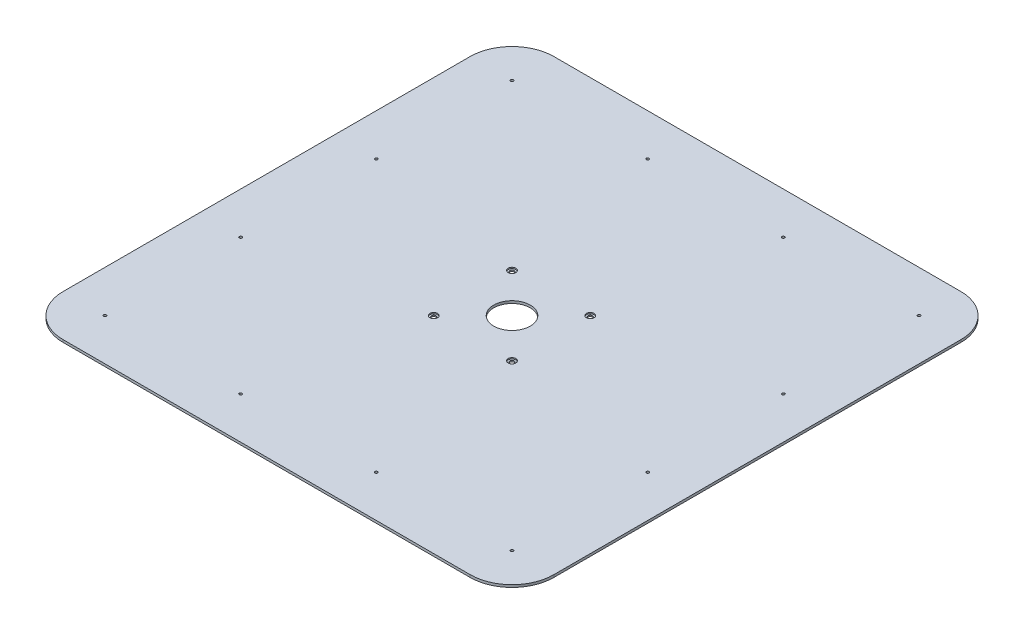
ISO-10303-21;
HEADER;
FILE_DESCRIPTION(('STEP AP214'),'2;1');
FILE_NAME('part.step','',(''),(''),'','','');
FILE_SCHEMA(('AUTOMOTIVE_DESIGN { 1 0 10303 214 1 1 1 1 }'));
ENDSEC;
DATA;
#1=APPLICATION_CONTEXT('core data for automotive mechanical design processes');
#2=APPLICATION_PROTOCOL_DEFINITION('international standard','automotive_design',2000,#1);
#3=PRODUCT_CONTEXT('',#1,'mechanical');
#4=PRODUCT('Part','Part','',(#3));
#5=PRODUCT_RELATED_PRODUCT_CATEGORY('part','',(#4));
#6=PRODUCT_DEFINITION_FORMATION('','',#4);
#7=PRODUCT_DEFINITION_CONTEXT('part definition',#1,'design');
#8=PRODUCT_DEFINITION('design','',#6,#7);
#9=PRODUCT_DEFINITION_SHAPE('','',#8);
#10=(LENGTH_UNIT() NAMED_UNIT(*) SI_UNIT(.MILLI.,.METRE.));
#11=(NAMED_UNIT(*) PLANE_ANGLE_UNIT() SI_UNIT($,.RADIAN.));
#12=(NAMED_UNIT(*) SI_UNIT($,.STERADIAN.) SOLID_ANGLE_UNIT());
#13=UNCERTAINTY_MEASURE_WITH_UNIT(LENGTH_MEASURE(1.E-05),#10,'distance_accuracy_value','');
#14=(GEOMETRIC_REPRESENTATION_CONTEXT(3) GLOBAL_UNCERTAINTY_ASSIGNED_CONTEXT((#13)) GLOBAL_UNIT_ASSIGNED_CONTEXT((#10,
#11,#12)) REPRESENTATION_CONTEXT('',''));
#15=CARTESIAN_POINT('',(0.,0.,0.));
#16=DIRECTION('',(0.,0.,1.));
#17=DIRECTION('',(1.,0.,0.));
#18=AXIS2_PLACEMENT_3D('',#15,#16,#17);
#19=CARTESIAN_POINT('',(-47.625,1.5,47.625));
#20=DIRECTION('',(0.,1.,0.));
#21=DIRECTION('',(0.,0.,1.));
#22=AXIS2_PLACEMENT_3D('',#19,#20,#21);
#23=CYLINDRICAL_SURFACE('',#22,4.699);
#24=CARTESIAN_POINT('',(-47.625,3.,47.625));
#25=DIRECTION('',(0.,1.,0.));
#26=DIRECTION('',(0.,0.,1.));
#27=AXIS2_PLACEMENT_3D('',#24,#25,#26);
#28=CIRCLE('',#27,4.699);
#29=CARTESIAN_POINT('',(-47.625,3.,52.324));
#30=VERTEX_POINT('',#29);
#31=EDGE_CURVE('E245',#30,#30,#28,.F.);
#32=ORIENTED_EDGE('',*,*,#31,.F.);
#33=EDGE_LOOP('',(#32));
#34=FACE_BOUND('',#33,.T.);
#35=CARTESIAN_POINT('',(-47.625,1.5,47.625));
#36=DIRECTION('',(0.,1.,0.));
#37=DIRECTION('',(0.,0.,1.));
#38=AXIS2_PLACEMENT_3D('',#35,#36,#37);
#39=CIRCLE('',#38,4.699);
#40=CARTESIAN_POINT('',(-47.625,1.5,52.324));
#41=VERTEX_POINT('',#40);
#42=EDGE_CURVE('E20',#41,#41,#39,.T.);
#43=ORIENTED_EDGE('',*,*,#42,.F.);
#44=EDGE_LOOP('',(#43));
#45=FACE_BOUND('',#44,.T.);
#46=ADVANCED_FACE('F17',(#34,#45),#23,.F.);
#47=CARTESIAN_POINT('',(47.625,1.5,47.625));
#48=DIRECTION('',(0.,1.,0.));
#49=DIRECTION('',(0.,0.,1.));
#50=AXIS2_PLACEMENT_3D('',#47,#48,#49);
#51=CYLINDRICAL_SURFACE('',#50,4.699);
#52=CARTESIAN_POINT('',(47.625,3.,47.625));
#53=DIRECTION('',(0.,1.,0.));
#54=DIRECTION('',(0.,0.,1.));
#55=AXIS2_PLACEMENT_3D('',#52,#53,#54);
#56=CIRCLE('',#55,4.699);
#57=CARTESIAN_POINT('',(47.625,3.,52.324));
#58=VERTEX_POINT('',#57);
#59=EDGE_CURVE('E242',#58,#58,#56,.F.);
#60=ORIENTED_EDGE('',*,*,#59,.F.);
#61=EDGE_LOOP('',(#60));
#62=FACE_BOUND('',#61,.T.);
#63=CARTESIAN_POINT('',(47.625,1.5,47.625));
#64=DIRECTION('',(0.,1.,0.));
#65=DIRECTION('',(0.,0.,1.));
#66=AXIS2_PLACEMENT_3D('',#63,#64,#65);
#67=CIRCLE('',#66,4.699);
#68=CARTESIAN_POINT('',(47.625,1.5,52.324));
#69=VERTEX_POINT('',#68);
#70=EDGE_CURVE('E253',#69,#69,#67,.T.);
#71=ORIENTED_EDGE('',*,*,#70,.F.);
#72=EDGE_LOOP('',(#71));
#73=FACE_BOUND('',#72,.T.);
#74=ADVANCED_FACE('F263',(#62,#73),#51,.F.);
#75=CARTESIAN_POINT('',(47.625,1.5,-47.625));
#76=DIRECTION('',(0.,1.,0.));
#77=DIRECTION('',(0.,0.,1.));
#78=AXIS2_PLACEMENT_3D('',#75,#76,#77);
#79=CYLINDRICAL_SURFACE('',#78,4.699);
#80=CARTESIAN_POINT('',(47.625,3.,-47.625));
#81=DIRECTION('',(0.,1.,0.));
#82=DIRECTION('',(0.,0.,1.));
#83=AXIS2_PLACEMENT_3D('',#80,#81,#82);
#84=CIRCLE('',#83,4.699);
#85=CARTESIAN_POINT('',(47.625,3.,-42.926));
#86=VERTEX_POINT('',#85);
#87=EDGE_CURVE('E239',#86,#86,#84,.F.);
#88=ORIENTED_EDGE('',*,*,#87,.F.);
#89=EDGE_LOOP('',(#88));
#90=FACE_BOUND('',#89,.T.);
#91=CARTESIAN_POINT('',(47.625,1.5,-47.625));
#92=DIRECTION('',(0.,1.,0.));
#93=DIRECTION('',(0.,0.,1.));
#94=AXIS2_PLACEMENT_3D('',#91,#92,#93);
#95=CIRCLE('',#94,4.699);
#96=CARTESIAN_POINT('',(47.625,1.5,-42.926));
#97=VERTEX_POINT('',#96);
#98=EDGE_CURVE('E251',#97,#97,#95,.T.);
#99=ORIENTED_EDGE('',*,*,#98,.F.);
#100=EDGE_LOOP('',(#99));
#101=FACE_BOUND('',#100,.T.);
#102=ADVANCED_FACE('F269',(#90,#101),#79,.F.);
#103=CARTESIAN_POINT('',(-47.625,1.5,-47.625));
#104=DIRECTION('',(0.,1.,0.));
#105=DIRECTION('',(0.,0.,1.));
#106=AXIS2_PLACEMENT_3D('',#103,#104,#105);
#107=CYLINDRICAL_SURFACE('',#106,4.699);
#108=CARTESIAN_POINT('',(-47.625,3.,-47.625));
#109=DIRECTION('',(0.,1.,0.));
#110=DIRECTION('',(0.,0.,1.));
#111=AXIS2_PLACEMENT_3D('',#108,#109,#110);
#112=CIRCLE('',#111,4.699);
#113=CARTESIAN_POINT('',(-47.625,3.,-42.926));
#114=VERTEX_POINT('',#113);
#115=EDGE_CURVE('E236',#114,#114,#112,.F.);
#116=ORIENTED_EDGE('',*,*,#115,.F.);
#117=EDGE_LOOP('',(#116));
#118=FACE_BOUND('',#117,.T.);
#119=CARTESIAN_POINT('',(-47.625,1.5,-47.625));
#120=DIRECTION('',(0.,1.,0.));
#121=DIRECTION('',(0.,0.,1.));
#122=AXIS2_PLACEMENT_3D('',#119,#120,#121);
#123=CIRCLE('',#122,4.699);
#124=CARTESIAN_POINT('',(-47.625,1.5,-42.926));
#125=VERTEX_POINT('',#124);
#126=EDGE_CURVE('E248',#125,#125,#123,.T.);
#127=ORIENTED_EDGE('',*,*,#126,.F.);
#128=EDGE_LOOP('',(#127));
#129=FACE_BOUND('',#128,.T.);
#130=ADVANCED_FACE('F393',(#118,#129),#107,.F.);
#131=CARTESIAN_POINT('',(-47.625,1.5,47.625));
#132=DIRECTION('',(0.,1.,0.));
#133=DIRECTION('',(0.,0.,1.));
#134=AXIS2_PLACEMENT_3D('',#131,#132,#133);
#135=PLANE('',#134);
#136=CARTESIAN_POINT('',(-47.625,1.5,47.625));
#137=DIRECTION('',(0.,1.,0.));
#138=DIRECTION('',(0.,0.,1.));
#139=AXIS2_PLACEMENT_3D('',#136,#137,#138);
#140=CIRCLE('',#139,2.667);
#141=CARTESIAN_POINT('',(-47.625,1.5,50.292));
#142=VERTEX_POINT('',#141);
#143=EDGE_CURVE('E233',#142,#142,#140,.F.);
#144=ORIENTED_EDGE('',*,*,#143,.T.);
#145=EDGE_LOOP('',(#144));
#146=FACE_BOUND('',#145,.T.);
#147=ORIENTED_EDGE('',*,*,#42,.T.);
#148=EDGE_LOOP('',(#147));
#149=FACE_BOUND('',#148,.T.);
#150=ADVANCED_FACE('F260',(#146,#149),#135,.T.);
#151=CARTESIAN_POINT('',(47.625,1.5,47.625));
#152=DIRECTION('',(0.,1.,0.));
#153=DIRECTION('',(0.,0.,1.));
#154=AXIS2_PLACEMENT_3D('',#151,#152,#153);
#155=PLANE('',#154);
#156=CARTESIAN_POINT('',(47.625,1.5,47.625));
#157=DIRECTION('',(0.,1.,0.));
#158=DIRECTION('',(0.,0.,1.));
#159=AXIS2_PLACEMENT_3D('',#156,#157,#158);
#160=CIRCLE('',#159,2.667);
#161=CARTESIAN_POINT('',(47.625,1.5,50.292));
#162=VERTEX_POINT('',#161);
#163=EDGE_CURVE('E230',#162,#162,#160,.F.);
#164=ORIENTED_EDGE('',*,*,#163,.T.);
#165=EDGE_LOOP('',(#164));
#166=FACE_BOUND('',#165,.T.);
#167=ORIENTED_EDGE('',*,*,#70,.T.);
#168=EDGE_LOOP('',(#167));
#169=FACE_BOUND('',#168,.T.);
#170=ADVANCED_FACE('F386',(#166,#169),#155,.T.);
#171=CARTESIAN_POINT('',(47.625,1.5,-47.625));
#172=DIRECTION('',(0.,1.,0.));
#173=DIRECTION('',(0.,0.,1.));
#174=AXIS2_PLACEMENT_3D('',#171,#172,#173);
#175=PLANE('',#174);
#176=CARTESIAN_POINT('',(47.625,1.5,-47.625));
#177=DIRECTION('',(0.,1.,0.));
#178=DIRECTION('',(0.,0.,1.));
#179=AXIS2_PLACEMENT_3D('',#176,#177,#178);
#180=CIRCLE('',#179,2.667);
#181=CARTESIAN_POINT('',(47.625,1.5,-44.958));
#182=VERTEX_POINT('',#181);
#183=EDGE_CURVE('E227',#182,#182,#180,.F.);
#184=ORIENTED_EDGE('',*,*,#183,.T.);
#185=EDGE_LOOP('',(#184));
#186=FACE_BOUND('',#185,.T.);
#187=ORIENTED_EDGE('',*,*,#98,.T.);
#188=EDGE_LOOP('',(#187));
#189=FACE_BOUND('',#188,.T.);
#190=ADVANCED_FACE('F382',(#186,#189),#175,.T.);
#191=CARTESIAN_POINT('',(-47.625,1.5,-47.625));
#192=DIRECTION('',(0.,1.,0.));
#193=DIRECTION('',(0.,0.,1.));
#194=AXIS2_PLACEMENT_3D('',#191,#192,#193);
#195=PLANE('',#194);
#196=CARTESIAN_POINT('',(-47.625,1.5,-47.625));
#197=DIRECTION('',(0.,1.,0.));
#198=DIRECTION('',(0.,0.,1.));
#199=AXIS2_PLACEMENT_3D('',#196,#197,#198);
#200=CIRCLE('',#199,2.667);
#201=CARTESIAN_POINT('',(-47.625,1.5,-44.958));
#202=VERTEX_POINT('',#201);
#203=EDGE_CURVE('E224',#202,#202,#200,.F.);
#204=ORIENTED_EDGE('',*,*,#203,.T.);
#205=EDGE_LOOP('',(#204));
#206=FACE_BOUND('',#205,.T.);
#207=ORIENTED_EDGE('',*,*,#126,.T.);
#208=EDGE_LOOP('',(#207));
#209=FACE_BOUND('',#208,.T.);
#210=ADVANCED_FACE('F378',(#206,#209),#195,.T.);
#211=CARTESIAN_POINT('',(0.,3.,0.));
#212=DIRECTION('',(0.,1.,0.));
#213=DIRECTION('',(0.,0.,1.));
#214=AXIS2_PLACEMENT_3D('',#211,#212,#213);
#215=PLANE('',#214);
#216=CARTESIAN_POINT('',(0.,3.,1.11022302462516E-13));
#217=DIRECTION('',(0.,-1.,0.));
#218=DIRECTION('',(0.,0.,-1.));
#219=AXIS2_PLACEMENT_3D('',#216,#217,#218);
#220=CIRCLE('',#219,22.225);
#221=CARTESIAN_POINT('',(0.,3.,-22.2249999999999));
#222=VERTEX_POINT('',#221);
#223=EDGE_CURVE('E111',#222,#222,#220,.T.);
#224=ORIENTED_EDGE('',*,*,#223,.T.);
#225=EDGE_LOOP('',(#224));
#226=FACE_BOUND('',#225,.T.);
#227=DIRECTION('',(0.,0.,1.));
#228=VECTOR('',#227,1.);
#229=CARTESIAN_POINT('',(298.45,3.,298.45));
#230=LINE('',#229,#228);
#231=CARTESIAN_POINT('',(298.45,3.,247.65));
#232=VERTEX_POINT('',#231);
#233=CARTESIAN_POINT('',(298.45,3.,-247.65));
#234=VERTEX_POINT('',#233);
#235=EDGE_CURVE('E117',#232,#234,#230,.F.);
#236=ORIENTED_EDGE('',*,*,#235,.T.);
#237=CARTESIAN_POINT('',(247.65,3.,-247.65));
#238=DIRECTION('',(0.,-1.,0.));
#239=DIRECTION('',(0.,0.,-1.));
#240=AXIS2_PLACEMENT_3D('',#237,#238,#239);
#241=CIRCLE('',#240,50.8);
#242=CARTESIAN_POINT('',(247.65,3.,-298.45));
#243=VERTEX_POINT('',#242);
#244=EDGE_CURVE('E118',#243,#234,#241,.T.);
#245=ORIENTED_EDGE('',*,*,#244,.F.);
#246=DIRECTION('',(1.,0.,0.));
#247=VECTOR('',#246,1.);
#248=CARTESIAN_POINT('',(298.45,3.,-298.45));
#249=LINE('',#248,#247);
#250=CARTESIAN_POINT('',(-247.65,3.,-298.45));
#251=VERTEX_POINT('',#250);
#252=EDGE_CURVE('E112',#243,#251,#249,.F.);
#253=ORIENTED_EDGE('',*,*,#252,.T.);
#254=CARTESIAN_POINT('',(-247.65,3.,-247.65));
#255=DIRECTION('',(0.,-1.,0.));
#256=DIRECTION('',(0.,0.,-1.));
#257=AXIS2_PLACEMENT_3D('',#254,#255,#256);
#258=CIRCLE('',#257,50.8);
#259=CARTESIAN_POINT('',(-298.45,3.,-247.65));
#260=VERTEX_POINT('',#259);
#261=EDGE_CURVE('E115',#260,#251,#258,.T.);
#262=ORIENTED_EDGE('',*,*,#261,.F.);
#263=DIRECTION('',(0.,0.,-1.));
#264=VECTOR('',#263,1.);
#265=CARTESIAN_POINT('',(-298.45,3.,298.45));
#266=LINE('',#265,#264);
#267=CARTESIAN_POINT('',(-298.45,3.,247.65));
#268=VERTEX_POINT('',#267);
#269=EDGE_CURVE('E88',#260,#268,#266,.F.);
#270=ORIENTED_EDGE('',*,*,#269,.T.);
#271=CARTESIAN_POINT('',(-247.65,3.,247.65));
#272=DIRECTION('',(0.,-1.,0.));
#273=DIRECTION('',(0.,0.,-1.));
#274=AXIS2_PLACEMENT_3D('',#271,#272,#273);
#275=CIRCLE('',#274,50.8);
#276=CARTESIAN_POINT('',(-247.65,3.,298.45));
#277=VERTEX_POINT('',#276);
#278=EDGE_CURVE('E81',#277,#268,#275,.T.);
#279=ORIENTED_EDGE('',*,*,#278,.F.);
#280=DIRECTION('',(-1.,0.,0.));
#281=VECTOR('',#280,1.);
#282=CARTESIAN_POINT('',(298.45,3.,298.45));
#283=LINE('',#282,#281);
#284=CARTESIAN_POINT('',(247.65,3.,298.45));
#285=VERTEX_POINT('',#284);
#286=EDGE_CURVE('E86',#277,#285,#283,.F.);
#287=ORIENTED_EDGE('',*,*,#286,.T.);
#288=CARTESIAN_POINT('',(247.65,3.,247.65));
#289=DIRECTION('',(0.,-1.,0.));
#290=DIRECTION('',(0.,0.,-1.));
#291=AXIS2_PLACEMENT_3D('',#288,#289,#290);
#292=CIRCLE('',#291,50.8);
#293=EDGE_CURVE('E101',#232,#285,#292,.T.);
#294=ORIENTED_EDGE('',*,*,#293,.F.);
#295=EDGE_LOOP('',(#236,#245,#253,#262,#270,#279,#287,#294));
#296=FACE_BOUND('',#295,.T.);
#297=CARTESIAN_POINT('',(-247.65,3.,-247.65));
#298=DIRECTION('',(0.,1.,0.));
#299=DIRECTION('',(0.,0.,1.));
#300=AXIS2_PLACEMENT_3D('',#297,#298,#299);
#301=CIRCLE('',#300,1.65100000000001);
#302=CARTESIAN_POINT('',(-247.65,3.,-245.999));
#303=VERTEX_POINT('',#302);
#304=EDGE_CURVE('E94',#303,#303,#301,.F.);
#305=ORIENTED_EDGE('',*,*,#304,.T.);
#306=EDGE_LOOP('',(#305));
#307=FACE_BOUND('',#306,.T.);
#308=CARTESIAN_POINT('',(247.65,3.,-247.65));
#309=DIRECTION('',(0.,1.,0.));
#310=DIRECTION('',(0.,0.,1.));
#311=AXIS2_PLACEMENT_3D('',#308,#309,#310);
#312=CIRCLE('',#311,1.65100000000001);
#313=CARTESIAN_POINT('',(247.65,3.,-245.999));
#314=VERTEX_POINT('',#313);
#315=EDGE_CURVE('E191',#314,#314,#312,.F.);
#316=ORIENTED_EDGE('',*,*,#315,.T.);
#317=EDGE_LOOP('',(#316));
#318=FACE_BOUND('',#317,.T.);
#319=CARTESIAN_POINT('',(247.65,3.,247.65));
#320=DIRECTION('',(0.,1.,0.));
#321=DIRECTION('',(0.,0.,1.));
#322=AXIS2_PLACEMENT_3D('',#319,#320,#321);
#323=CIRCLE('',#322,1.65100000000001);
#324=CARTESIAN_POINT('',(247.65,3.,249.301));
#325=VERTEX_POINT('',#324);
#326=EDGE_CURVE('E194',#325,#325,#323,.F.);
#327=ORIENTED_EDGE('',*,*,#326,.T.);
#328=EDGE_LOOP('',(#327));
#329=FACE_BOUND('',#328,.T.);
#330=CARTESIAN_POINT('',(-247.65,3.,247.65));
#331=DIRECTION('',(0.,1.,0.));
#332=DIRECTION('',(0.,0.,1.));
#333=AXIS2_PLACEMENT_3D('',#330,#331,#332);
#334=CIRCLE('',#333,1.65100000000001);
#335=CARTESIAN_POINT('',(-247.65,3.,249.301));
#336=VERTEX_POINT('',#335);
#337=EDGE_CURVE('E197',#336,#336,#334,.F.);
#338=ORIENTED_EDGE('',*,*,#337,.T.);
#339=EDGE_LOOP('',(#338));
#340=FACE_BOUND('',#339,.T.);
#341=CARTESIAN_POINT('',(82.55,3.,-247.65));
#342=DIRECTION('',(0.,1.,0.));
#343=DIRECTION('',(0.,0.,1.));
#344=AXIS2_PLACEMENT_3D('',#341,#342,#343);
#345=CIRCLE('',#344,1.65100000000001);
#346=CARTESIAN_POINT('',(82.55,3.,-245.999));
#347=VERTEX_POINT('',#346);
#348=EDGE_CURVE('E200',#347,#347,#345,.F.);
#349=ORIENTED_EDGE('',*,*,#348,.T.);
#350=EDGE_LOOP('',(#349));
#351=FACE_BOUND('',#350,.T.);
#352=CARTESIAN_POINT('',(-82.55,3.,-247.65));
#353=DIRECTION('',(0.,1.,0.));
#354=DIRECTION('',(0.,0.,1.));
#355=AXIS2_PLACEMENT_3D('',#352,#353,#354);
#356=CIRCLE('',#355,1.65100000000001);
#357=CARTESIAN_POINT('',(-82.55,3.,-245.999));
#358=VERTEX_POINT('',#357);
#359=EDGE_CURVE('E203',#358,#358,#356,.F.);
#360=ORIENTED_EDGE('',*,*,#359,.T.);
#361=EDGE_LOOP('',(#360));
#362=FACE_BOUND('',#361,.T.);
#363=CARTESIAN_POINT('',(247.65,3.,-82.5499999999999));
#364=DIRECTION('',(0.,1.,0.));
#365=DIRECTION('',(0.,0.,1.));
#366=AXIS2_PLACEMENT_3D('',#363,#364,#365);
#367=CIRCLE('',#366,1.65100000000001);
#368=CARTESIAN_POINT('',(247.65,3.,-80.8989999999999));
#369=VERTEX_POINT('',#368);
#370=EDGE_CURVE('E206',#369,#369,#367,.F.);
#371=ORIENTED_EDGE('',*,*,#370,.T.);
#372=EDGE_LOOP('',(#371));
#373=FACE_BOUND('',#372,.T.);
#374=CARTESIAN_POINT('',(247.65,3.,82.5499999999999));
#375=DIRECTION('',(0.,1.,0.));
#376=DIRECTION('',(0.,0.,1.));
#377=AXIS2_PLACEMENT_3D('',#374,#375,#376);
#378=CIRCLE('',#377,1.65100000000001);
#379=CARTESIAN_POINT('',(247.65,3.,84.2009999999999));
#380=VERTEX_POINT('',#379);
#381=EDGE_CURVE('E209',#380,#380,#378,.F.);
#382=ORIENTED_EDGE('',*,*,#381,.T.);
#383=EDGE_LOOP('',(#382));
#384=FACE_BOUND('',#383,.T.);
#385=CARTESIAN_POINT('',(82.55,3.,247.65));
#386=DIRECTION('',(0.,1.,0.));
#387=DIRECTION('',(0.,0.,1.));
#388=AXIS2_PLACEMENT_3D('',#385,#386,#387);
#389=CIRCLE('',#388,1.65100000000001);
#390=CARTESIAN_POINT('',(82.55,3.,249.301));
#391=VERTEX_POINT('',#390);
#392=EDGE_CURVE('E212',#391,#391,#389,.F.);
#393=ORIENTED_EDGE('',*,*,#392,.T.);
#394=EDGE_LOOP('',(#393));
#395=FACE_BOUND('',#394,.T.);
#396=CARTESIAN_POINT('',(-82.55,3.,247.65));
#397=DIRECTION('',(0.,1.,0.));
#398=DIRECTION('',(0.,0.,1.));
#399=AXIS2_PLACEMENT_3D('',#396,#397,#398);
#400=CIRCLE('',#399,1.65100000000001);
#401=CARTESIAN_POINT('',(-82.55,3.,249.301));
#402=VERTEX_POINT('',#401);
#403=EDGE_CURVE('E215',#402,#402,#400,.F.);
#404=ORIENTED_EDGE('',*,*,#403,.T.);
#405=EDGE_LOOP('',(#404));
#406=FACE_BOUND('',#405,.T.);
#407=CARTESIAN_POINT('',(-247.65,3.,82.5499999999999));
#408=DIRECTION('',(0.,1.,0.));
#409=DIRECTION('',(0.,0.,1.));
#410=AXIS2_PLACEMENT_3D('',#407,#408,#409);
#411=CIRCLE('',#410,1.65100000000001);
#412=CARTESIAN_POINT('',(-247.65,3.,84.2009999999999));
#413=VERTEX_POINT('',#412);
#414=EDGE_CURVE('E218',#413,#413,#411,.F.);
#415=ORIENTED_EDGE('',*,*,#414,.T.);
#416=EDGE_LOOP('',(#415));
#417=FACE_BOUND('',#416,.T.);
#418=CARTESIAN_POINT('',(-247.65,3.,-82.5499999999999));
#419=DIRECTION('',(0.,1.,0.));
#420=DIRECTION('',(0.,0.,1.));
#421=AXIS2_PLACEMENT_3D('',#418,#419,#420);
#422=CIRCLE('',#421,1.65100000000001);
#423=CARTESIAN_POINT('',(-247.65,3.,-80.8989999999999));
#424=VERTEX_POINT('',#423);
#425=EDGE_CURVE('E221',#424,#424,#422,.F.);
#426=ORIENTED_EDGE('',*,*,#425,.T.);
#427=EDGE_LOOP('',(#426));
#428=FACE_BOUND('',#427,.T.);
#429=ORIENTED_EDGE('',*,*,#115,.T.);
#430=EDGE_LOOP('',(#429));
#431=FACE_BOUND('',#430,.T.);
#432=ORIENTED_EDGE('',*,*,#87,.T.);
#433=EDGE_LOOP('',(#432));
#434=FACE_BOUND('',#433,.T.);
#435=ORIENTED_EDGE('',*,*,#59,.T.);
#436=EDGE_LOOP('',(#435));
#437=FACE_BOUND('',#436,.T.);
#438=ORIENTED_EDGE('',*,*,#31,.T.);
#439=EDGE_LOOP('',(#438));
#440=FACE_BOUND('',#439,.T.);
#441=ADVANCED_FACE('F84',(#226,#296,#307,#318,#329,#340,#351,#362,#373,#384,#395,#406,#417,#428,
#431,#434,#437,#440),#215,.T.);
#442=CARTESIAN_POINT('',(-47.625,0.,47.625));
#443=DIRECTION('',(0.,1.,0.));
#444=DIRECTION('',(0.,0.,1.));
#445=AXIS2_PLACEMENT_3D('',#442,#443,#444);
#446=CYLINDRICAL_SURFACE('',#445,2.667);
#447=CARTESIAN_POINT('',(-47.625,0.,47.625));
#448=DIRECTION('',(0.,1.,0.));
#449=DIRECTION('',(0.,0.,1.));
#450=AXIS2_PLACEMENT_3D('',#447,#448,#449);
#451=CIRCLE('',#450,2.667);
#452=CARTESIAN_POINT('',(-47.625,0.,50.292));
#453=VERTEX_POINT('',#452);
#454=EDGE_CURVE('E179',#453,#453,#451,.F.);
#455=ORIENTED_EDGE('',*,*,#454,.T.);
#456=EDGE_LOOP('',(#455));
#457=FACE_BOUND('',#456,.T.);
#458=ORIENTED_EDGE('',*,*,#143,.F.);
#459=EDGE_LOOP('',(#458));
#460=FACE_BOUND('',#459,.T.);
#461=ADVANCED_FACE('F371',(#457,#460),#446,.F.);
#462=CARTESIAN_POINT('',(47.625,0.,47.625));
#463=DIRECTION('',(0.,1.,0.));
#464=DIRECTION('',(0.,0.,1.));
#465=AXIS2_PLACEMENT_3D('',#462,#463,#464);
#466=CYLINDRICAL_SURFACE('',#465,2.667);
#467=CARTESIAN_POINT('',(47.625,0.,47.625));
#468=DIRECTION('',(0.,1.,0.));
#469=DIRECTION('',(0.,0.,1.));
#470=AXIS2_PLACEMENT_3D('',#467,#468,#469);
#471=CIRCLE('',#470,2.667);
#472=CARTESIAN_POINT('',(47.625,0.,50.292));
#473=VERTEX_POINT('',#472);
#474=EDGE_CURVE('E176',#473,#473,#471,.F.);
#475=ORIENTED_EDGE('',*,*,#474,.T.);
#476=EDGE_LOOP('',(#475));
#477=FACE_BOUND('',#476,.T.);
#478=ORIENTED_EDGE('',*,*,#163,.F.);
#479=EDGE_LOOP('',(#478));
#480=FACE_BOUND('',#479,.T.);
#481=ADVANCED_FACE('F367',(#477,#480),#466,.F.);
#482=CARTESIAN_POINT('',(47.625,0.,-47.625));
#483=DIRECTION('',(0.,1.,0.));
#484=DIRECTION('',(0.,0.,1.));
#485=AXIS2_PLACEMENT_3D('',#482,#483,#484);
#486=CYLINDRICAL_SURFACE('',#485,2.667);
#487=CARTESIAN_POINT('',(47.625,0.,-47.625));
#488=DIRECTION('',(0.,1.,0.));
#489=DIRECTION('',(0.,0.,1.));
#490=AXIS2_PLACEMENT_3D('',#487,#488,#489);
#491=CIRCLE('',#490,2.667);
#492=CARTESIAN_POINT('',(47.625,0.,-44.958));
#493=VERTEX_POINT('',#492);
#494=EDGE_CURVE('E173',#493,#493,#491,.F.);
#495=ORIENTED_EDGE('',*,*,#494,.T.);
#496=EDGE_LOOP('',(#495));
#497=FACE_BOUND('',#496,.T.);
#498=ORIENTED_EDGE('',*,*,#183,.F.);
#499=EDGE_LOOP('',(#498));
#500=FACE_BOUND('',#499,.T.);
#501=ADVANCED_FACE('F363',(#497,#500),#486,.F.);
#502=CARTESIAN_POINT('',(-47.625,0.,-47.625));
#503=DIRECTION('',(0.,1.,0.));
#504=DIRECTION('',(0.,0.,1.));
#505=AXIS2_PLACEMENT_3D('',#502,#503,#504);
#506=CYLINDRICAL_SURFACE('',#505,2.667);
#507=CARTESIAN_POINT('',(-47.625,0.,-47.625));
#508=DIRECTION('',(0.,1.,0.));
#509=DIRECTION('',(0.,0.,1.));
#510=AXIS2_PLACEMENT_3D('',#507,#508,#509);
#511=CIRCLE('',#510,2.667);
#512=CARTESIAN_POINT('',(-47.625,0.,-44.958));
#513=VERTEX_POINT('',#512);
#514=EDGE_CURVE('E170',#513,#513,#511,.F.);
#515=ORIENTED_EDGE('',*,*,#514,.T.);
#516=EDGE_LOOP('',(#515));
#517=FACE_BOUND('',#516,.T.);
#518=ORIENTED_EDGE('',*,*,#203,.F.);
#519=EDGE_LOOP('',(#518));
#520=FACE_BOUND('',#519,.T.);
#521=ADVANCED_FACE('F359',(#517,#520),#506,.F.);
#522=CARTESIAN_POINT('',(-247.65,0.,-82.5499999999999));
#523=DIRECTION('',(0.,1.,0.));
#524=DIRECTION('',(0.,0.,1.));
#525=AXIS2_PLACEMENT_3D('',#522,#523,#524);
#526=CYLINDRICAL_SURFACE('',#525,1.65100000000001);
#527=CARTESIAN_POINT('',(-247.65,0.,-82.5499999999999));
#528=DIRECTION('',(0.,1.,0.));
#529=DIRECTION('',(0.,0.,1.));
#530=AXIS2_PLACEMENT_3D('',#527,#528,#529);
#531=CIRCLE('',#530,1.65100000000001);
#532=CARTESIAN_POINT('',(-247.65,0.,-80.8989999999999));
#533=VERTEX_POINT('',#532);
#534=EDGE_CURVE('E167',#533,#533,#531,.F.);
#535=ORIENTED_EDGE('',*,*,#534,.T.);
#536=EDGE_LOOP('',(#535));
#537=FACE_BOUND('',#536,.T.);
#538=ORIENTED_EDGE('',*,*,#425,.F.);
#539=EDGE_LOOP('',(#538));
#540=FACE_BOUND('',#539,.T.);
#541=ADVANCED_FACE('F355',(#537,#540),#526,.F.);
#542=CARTESIAN_POINT('',(-247.65,0.,82.5499999999999));
#543=DIRECTION('',(0.,1.,0.));
#544=DIRECTION('',(0.,0.,1.));
#545=AXIS2_PLACEMENT_3D('',#542,#543,#544);
#546=CYLINDRICAL_SURFACE('',#545,1.65100000000001);
#547=CARTESIAN_POINT('',(-247.65,0.,82.5499999999999));
#548=DIRECTION('',(0.,1.,0.));
#549=DIRECTION('',(0.,0.,1.));
#550=AXIS2_PLACEMENT_3D('',#547,#548,#549);
#551=CIRCLE('',#550,1.65100000000001);
#552=CARTESIAN_POINT('',(-247.65,0.,84.2009999999999));
#553=VERTEX_POINT('',#552);
#554=EDGE_CURVE('E164',#553,#553,#551,.F.);
#555=ORIENTED_EDGE('',*,*,#554,.T.);
#556=EDGE_LOOP('',(#555));
#557=FACE_BOUND('',#556,.T.);
#558=ORIENTED_EDGE('',*,*,#414,.F.);
#559=EDGE_LOOP('',(#558));
#560=FACE_BOUND('',#559,.T.);
#561=ADVANCED_FACE('F351',(#557,#560),#546,.F.);
#562=CARTESIAN_POINT('',(-82.55,0.,247.65));
#563=DIRECTION('',(0.,1.,0.));
#564=DIRECTION('',(0.,0.,1.));
#565=AXIS2_PLACEMENT_3D('',#562,#563,#564);
#566=CYLINDRICAL_SURFACE('',#565,1.65100000000001);
#567=CARTESIAN_POINT('',(-82.55,0.,247.65));
#568=DIRECTION('',(0.,1.,0.));
#569=DIRECTION('',(0.,0.,1.));
#570=AXIS2_PLACEMENT_3D('',#567,#568,#569);
#571=CIRCLE('',#570,1.65100000000001);
#572=CARTESIAN_POINT('',(-82.55,0.,249.301));
#573=VERTEX_POINT('',#572);
#574=EDGE_CURVE('E161',#573,#573,#571,.F.);
#575=ORIENTED_EDGE('',*,*,#574,.T.);
#576=EDGE_LOOP('',(#575));
#577=FACE_BOUND('',#576,.T.);
#578=ORIENTED_EDGE('',*,*,#403,.F.);
#579=EDGE_LOOP('',(#578));
#580=FACE_BOUND('',#579,.T.);
#581=ADVANCED_FACE('F347',(#577,#580),#566,.F.);
#582=CARTESIAN_POINT('',(82.55,0.,247.65));
#583=DIRECTION('',(0.,1.,0.));
#584=DIRECTION('',(0.,0.,1.));
#585=AXIS2_PLACEMENT_3D('',#582,#583,#584);
#586=CYLINDRICAL_SURFACE('',#585,1.65100000000001);
#587=CARTESIAN_POINT('',(82.55,0.,247.65));
#588=DIRECTION('',(0.,1.,0.));
#589=DIRECTION('',(0.,0.,1.));
#590=AXIS2_PLACEMENT_3D('',#587,#588,#589);
#591=CIRCLE('',#590,1.65100000000001);
#592=CARTESIAN_POINT('',(82.55,0.,249.301));
#593=VERTEX_POINT('',#592);
#594=EDGE_CURVE('E158',#593,#593,#591,.F.);
#595=ORIENTED_EDGE('',*,*,#594,.T.);
#596=EDGE_LOOP('',(#595));
#597=FACE_BOUND('',#596,.T.);
#598=ORIENTED_EDGE('',*,*,#392,.F.);
#599=EDGE_LOOP('',(#598));
#600=FACE_BOUND('',#599,.T.);
#601=ADVANCED_FACE('F343',(#597,#600),#586,.F.);
#602=CARTESIAN_POINT('',(247.65,0.,82.5499999999999));
#603=DIRECTION('',(0.,1.,0.));
#604=DIRECTION('',(0.,0.,1.));
#605=AXIS2_PLACEMENT_3D('',#602,#603,#604);
#606=CYLINDRICAL_SURFACE('',#605,1.65100000000001);
#607=CARTESIAN_POINT('',(247.65,0.,82.5499999999999));
#608=DIRECTION('',(0.,1.,0.));
#609=DIRECTION('',(0.,0.,1.));
#610=AXIS2_PLACEMENT_3D('',#607,#608,#609);
#611=CIRCLE('',#610,1.65100000000001);
#612=CARTESIAN_POINT('',(247.65,0.,84.2009999999999));
#613=VERTEX_POINT('',#612);
#614=EDGE_CURVE('E155',#613,#613,#611,.F.);
#615=ORIENTED_EDGE('',*,*,#614,.T.);
#616=EDGE_LOOP('',(#615));
#617=FACE_BOUND('',#616,.T.);
#618=ORIENTED_EDGE('',*,*,#381,.F.);
#619=EDGE_LOOP('',(#618));
#620=FACE_BOUND('',#619,.T.);
#621=ADVANCED_FACE('F339',(#617,#620),#606,.F.);
#622=CARTESIAN_POINT('',(247.65,0.,-82.5499999999999));
#623=DIRECTION('',(0.,1.,0.));
#624=DIRECTION('',(0.,0.,1.));
#625=AXIS2_PLACEMENT_3D('',#622,#623,#624);
#626=CYLINDRICAL_SURFACE('',#625,1.65100000000001);
#627=CARTESIAN_POINT('',(247.65,0.,-82.5499999999999));
#628=DIRECTION('',(0.,1.,0.));
#629=DIRECTION('',(0.,0.,1.));
#630=AXIS2_PLACEMENT_3D('',#627,#628,#629);
#631=CIRCLE('',#630,1.65100000000001);
#632=CARTESIAN_POINT('',(247.65,0.,-80.8989999999999));
#633=VERTEX_POINT('',#632);
#634=EDGE_CURVE('E152',#633,#633,#631,.F.);
#635=ORIENTED_EDGE('',*,*,#634,.T.);
#636=EDGE_LOOP('',(#635));
#637=FACE_BOUND('',#636,.T.);
#638=ORIENTED_EDGE('',*,*,#370,.F.);
#639=EDGE_LOOP('',(#638));
#640=FACE_BOUND('',#639,.T.);
#641=ADVANCED_FACE('F335',(#637,#640),#626,.F.);
#642=CARTESIAN_POINT('',(-82.55,0.,-247.65));
#643=DIRECTION('',(0.,1.,0.));
#644=DIRECTION('',(0.,0.,1.));
#645=AXIS2_PLACEMENT_3D('',#642,#643,#644);
#646=CYLINDRICAL_SURFACE('',#645,1.65100000000001);
#647=CARTESIAN_POINT('',(-82.55,0.,-247.65));
#648=DIRECTION('',(0.,1.,0.));
#649=DIRECTION('',(0.,0.,1.));
#650=AXIS2_PLACEMENT_3D('',#647,#648,#649);
#651=CIRCLE('',#650,1.65100000000001);
#652=CARTESIAN_POINT('',(-82.55,0.,-245.999));
#653=VERTEX_POINT('',#652);
#654=EDGE_CURVE('E149',#653,#653,#651,.F.);
#655=ORIENTED_EDGE('',*,*,#654,.T.);
#656=EDGE_LOOP('',(#655));
#657=FACE_BOUND('',#656,.T.);
#658=ORIENTED_EDGE('',*,*,#359,.F.);
#659=EDGE_LOOP('',(#658));
#660=FACE_BOUND('',#659,.T.);
#661=ADVANCED_FACE('F331',(#657,#660),#646,.F.);
#662=CARTESIAN_POINT('',(82.55,0.,-247.65));
#663=DIRECTION('',(0.,1.,0.));
#664=DIRECTION('',(0.,0.,1.));
#665=AXIS2_PLACEMENT_3D('',#662,#663,#664);
#666=CYLINDRICAL_SURFACE('',#665,1.65100000000001);
#667=CARTESIAN_POINT('',(82.55,0.,-247.65));
#668=DIRECTION('',(0.,1.,0.));
#669=DIRECTION('',(0.,0.,1.));
#670=AXIS2_PLACEMENT_3D('',#667,#668,#669);
#671=CIRCLE('',#670,1.65100000000001);
#672=CARTESIAN_POINT('',(82.55,0.,-245.999));
#673=VERTEX_POINT('',#672);
#674=EDGE_CURVE('E146',#673,#673,#671,.F.);
#675=ORIENTED_EDGE('',*,*,#674,.T.);
#676=EDGE_LOOP('',(#675));
#677=FACE_BOUND('',#676,.T.);
#678=ORIENTED_EDGE('',*,*,#348,.F.);
#679=EDGE_LOOP('',(#678));
#680=FACE_BOUND('',#679,.T.);
#681=ADVANCED_FACE('F327',(#677,#680),#666,.F.);
#682=CARTESIAN_POINT('',(-247.65,0.,247.65));
#683=DIRECTION('',(0.,1.,0.));
#684=DIRECTION('',(0.,0.,1.));
#685=AXIS2_PLACEMENT_3D('',#682,#683,#684);
#686=CYLINDRICAL_SURFACE('',#685,1.65100000000001);
#687=CARTESIAN_POINT('',(-247.65,0.,247.65));
#688=DIRECTION('',(0.,1.,0.));
#689=DIRECTION('',(0.,0.,1.));
#690=AXIS2_PLACEMENT_3D('',#687,#688,#689);
#691=CIRCLE('',#690,1.65100000000001);
#692=CARTESIAN_POINT('',(-247.65,0.,249.301));
#693=VERTEX_POINT('',#692);
#694=EDGE_CURVE('E143',#693,#693,#691,.F.);
#695=ORIENTED_EDGE('',*,*,#694,.T.);
#696=EDGE_LOOP('',(#695));
#697=FACE_BOUND('',#696,.T.);
#698=ORIENTED_EDGE('',*,*,#337,.F.);
#699=EDGE_LOOP('',(#698));
#700=FACE_BOUND('',#699,.T.);
#701=ADVANCED_FACE('F323',(#697,#700),#686,.F.);
#702=CARTESIAN_POINT('',(247.65,0.,247.65));
#703=DIRECTION('',(0.,1.,0.));
#704=DIRECTION('',(0.,0.,1.));
#705=AXIS2_PLACEMENT_3D('',#702,#703,#704);
#706=CYLINDRICAL_SURFACE('',#705,1.65100000000001);
#707=CARTESIAN_POINT('',(247.65,0.,247.65));
#708=DIRECTION('',(0.,1.,0.));
#709=DIRECTION('',(0.,0.,1.));
#710=AXIS2_PLACEMENT_3D('',#707,#708,#709);
#711=CIRCLE('',#710,1.65100000000001);
#712=CARTESIAN_POINT('',(247.65,0.,249.301));
#713=VERTEX_POINT('',#712);
#714=EDGE_CURVE('E140',#713,#713,#711,.F.);
#715=ORIENTED_EDGE('',*,*,#714,.T.);
#716=EDGE_LOOP('',(#715));
#717=FACE_BOUND('',#716,.T.);
#718=ORIENTED_EDGE('',*,*,#326,.F.);
#719=EDGE_LOOP('',(#718));
#720=FACE_BOUND('',#719,.T.);
#721=ADVANCED_FACE('F319',(#717,#720),#706,.F.);
#722=CARTESIAN_POINT('',(247.65,0.,-247.65));
#723=DIRECTION('',(0.,1.,0.));
#724=DIRECTION('',(0.,0.,1.));
#725=AXIS2_PLACEMENT_3D('',#722,#723,#724);
#726=CYLINDRICAL_SURFACE('',#725,1.65100000000001);
#727=CARTESIAN_POINT('',(247.65,0.,-247.65));
#728=DIRECTION('',(0.,1.,0.));
#729=DIRECTION('',(0.,0.,1.));
#730=AXIS2_PLACEMENT_3D('',#727,#728,#729);
#731=CIRCLE('',#730,1.65100000000001);
#732=CARTESIAN_POINT('',(247.65,0.,-245.999));
#733=VERTEX_POINT('',#732);
#734=EDGE_CURVE('E137',#733,#733,#731,.F.);
#735=ORIENTED_EDGE('',*,*,#734,.T.);
#736=EDGE_LOOP('',(#735));
#737=FACE_BOUND('',#736,.T.);
#738=ORIENTED_EDGE('',*,*,#315,.F.);
#739=EDGE_LOOP('',(#738));
#740=FACE_BOUND('',#739,.T.);
#741=ADVANCED_FACE('F315',(#737,#740),#726,.F.);
#742=CARTESIAN_POINT('',(-247.65,0.,-247.65));
#743=DIRECTION('',(0.,1.,0.));
#744=DIRECTION('',(0.,0.,1.));
#745=AXIS2_PLACEMENT_3D('',#742,#743,#744);
#746=CYLINDRICAL_SURFACE('',#745,1.65100000000001);
#747=CARTESIAN_POINT('',(-247.65,0.,-247.65));
#748=DIRECTION('',(0.,1.,0.));
#749=DIRECTION('',(0.,0.,1.));
#750=AXIS2_PLACEMENT_3D('',#747,#748,#749);
#751=CIRCLE('',#750,1.65100000000001);
#752=CARTESIAN_POINT('',(-247.65,0.,-245.999));
#753=VERTEX_POINT('',#752);
#754=EDGE_CURVE('E134',#753,#753,#751,.F.);
#755=ORIENTED_EDGE('',*,*,#754,.T.);
#756=EDGE_LOOP('',(#755));
#757=FACE_BOUND('',#756,.T.);
#758=ORIENTED_EDGE('',*,*,#304,.F.);
#759=EDGE_LOOP('',(#758));
#760=FACE_BOUND('',#759,.T.);
#761=ADVANCED_FACE('F312',(#757,#760),#746,.F.);
#762=CARTESIAN_POINT('',(-247.65,3.,247.65));
#763=DIRECTION('',(0.,-1.,0.));
#764=DIRECTION('',(0.,0.,-1.));
#765=AXIS2_PLACEMENT_3D('',#762,#763,#764);
#766=CYLINDRICAL_SURFACE('',#765,50.8);
#767=CARTESIAN_POINT('',(-247.65,0.,247.65));
#768=DIRECTION('',(0.,-1.,0.));
#769=DIRECTION('',(0.,0.,-1.));
#770=AXIS2_PLACEMENT_3D('',#767,#768,#769);
#771=CIRCLE('',#770,50.8);
#772=CARTESIAN_POINT('',(-298.45,0.,247.65));
#773=VERTEX_POINT('',#772);
#774=CARTESIAN_POINT('',(-247.65,0.,298.45));
#775=VERTEX_POINT('',#774);
#776=EDGE_CURVE('E105',#773,#775,#771,.F.);
#777=ORIENTED_EDGE('',*,*,#776,.T.);
#778=DIRECTION('',(0.,1.,0.));
#779=VECTOR('',#778,1.);
#780=CARTESIAN_POINT('',(-247.65,3.,298.45));
#781=LINE('',#780,#779);
#782=EDGE_CURVE('E93',#775,#277,#781,.T.);
#783=ORIENTED_EDGE('',*,*,#782,.T.);
#784=ORIENTED_EDGE('',*,*,#278,.T.);
#785=DIRECTION('',(0.,1.,0.));
#786=VECTOR('',#785,1.);
#787=CARTESIAN_POINT('',(-298.45,3.,247.65));
#788=LINE('',#787,#786);
#789=EDGE_CURVE('E746',#268,#773,#788,.F.);
#790=ORIENTED_EDGE('',*,*,#789,.T.);
#791=EDGE_LOOP('',(#777,#783,#784,#790));
#792=FACE_BOUND('',#791,.T.);
#793=ADVANCED_FACE('F104',(#792),#766,.T.);
#794=CARTESIAN_POINT('',(298.45,3.,298.45));
#795=DIRECTION('',(0.,0.,-1.));
#796=DIRECTION('',(-1.,0.,0.));
#797=AXIS2_PLACEMENT_3D('',#794,#795,#796);
#798=PLANE('',#797);
#799=ORIENTED_EDGE('',*,*,#782,.F.);
#800=DIRECTION('',(1.,0.,0.));
#801=VECTOR('',#800,1.);
#802=CARTESIAN_POINT('',(0.,0.,298.45));
#803=LINE('',#802,#801);
#804=CARTESIAN_POINT('',(247.65,0.,298.45));
#805=VERTEX_POINT('',#804);
#806=EDGE_CURVE('E132',#775,#805,#803,.T.);
#807=ORIENTED_EDGE('',*,*,#806,.T.);
#808=DIRECTION('',(0.,-1.,0.));
#809=VECTOR('',#808,1.);
#810=CARTESIAN_POINT('',(247.65,3.,298.45));
#811=LINE('',#810,#809);
#812=EDGE_CURVE('E100',#285,#805,#811,.T.);
#813=ORIENTED_EDGE('',*,*,#812,.F.);
#814=ORIENTED_EDGE('',*,*,#286,.F.);
#815=EDGE_LOOP('',(#799,#807,#813,#814));
#816=FACE_BOUND('',#815,.T.);
#817=ADVANCED_FACE('F97',(#816),#798,.F.);
#818=CARTESIAN_POINT('',(247.65,3.,247.65));
#819=DIRECTION('',(0.,-1.,0.));
#820=DIRECTION('',(0.,0.,-1.));
#821=AXIS2_PLACEMENT_3D('',#818,#819,#820);
#822=CYLINDRICAL_SURFACE('',#821,50.8);
#823=CARTESIAN_POINT('',(247.65,0.,247.65));
#824=DIRECTION('',(0.,-1.,0.));
#825=DIRECTION('',(0.,0.,-1.));
#826=AXIS2_PLACEMENT_3D('',#823,#824,#825);
#827=CIRCLE('',#826,50.8);
#828=CARTESIAN_POINT('',(298.45,0.,247.65));
#829=VERTEX_POINT('',#828);
#830=EDGE_CURVE('E129',#805,#829,#827,.F.);
#831=ORIENTED_EDGE('',*,*,#830,.T.);
#832=DIRECTION('',(0.,1.,0.));
#833=VECTOR('',#832,1.);
#834=CARTESIAN_POINT('',(298.45,3.,247.65));
#835=LINE('',#834,#833);
#836=EDGE_CURVE('E119',#829,#232,#835,.T.);
#837=ORIENTED_EDGE('',*,*,#836,.T.);
#838=ORIENTED_EDGE('',*,*,#293,.T.);
#839=ORIENTED_EDGE('',*,*,#812,.T.);
#840=EDGE_LOOP('',(#831,#837,#838,#839));
#841=FACE_BOUND('',#840,.T.);
#842=ADVANCED_FACE('F303',(#841),#822,.T.);
#843=CARTESIAN_POINT('',(298.45,3.,298.45));
#844=DIRECTION('',(-1.,0.,0.));
#845=DIRECTION('',(0.,0.,1.));
#846=AXIS2_PLACEMENT_3D('',#843,#844,#845);
#847=PLANE('',#846);
#848=DIRECTION('',(0.,-1.,0.));
#849=VECTOR('',#848,1.);
#850=CARTESIAN_POINT('',(298.45,3.,-247.65));
#851=LINE('',#850,#849);
#852=CARTESIAN_POINT('',(298.45,0.,-247.65));
#853=VERTEX_POINT('',#852);
#854=EDGE_CURVE('E187',#234,#853,#851,.T.);
#855=ORIENTED_EDGE('',*,*,#854,.F.);
#856=ORIENTED_EDGE('',*,*,#235,.F.);
#857=ORIENTED_EDGE('',*,*,#836,.F.);
#858=DIRECTION('',(0.,0.,1.));
#859=VECTOR('',#858,1.);
#860=CARTESIAN_POINT('',(298.45,0.,0.));
#861=LINE('',#860,#859);
#862=EDGE_CURVE('E128',#829,#853,#861,.F.);
#863=ORIENTED_EDGE('',*,*,#862,.T.);
#864=EDGE_LOOP('',(#855,#856,#857,#863));
#865=FACE_BOUND('',#864,.T.);
#866=ADVANCED_FACE('F299',(#865),#847,.F.);
#867=CARTESIAN_POINT('',(247.65,3.,-247.65));
#868=DIRECTION('',(0.,-1.,0.));
#869=DIRECTION('',(0.,0.,-1.));
#870=AXIS2_PLACEMENT_3D('',#867,#868,#869);
#871=CYLINDRICAL_SURFACE('',#870,50.8);
#872=CARTESIAN_POINT('',(247.65,0.,-247.65));
#873=DIRECTION('',(0.,-1.,0.));
#874=DIRECTION('',(0.,0.,-1.));
#875=AXIS2_PLACEMENT_3D('',#872,#873,#874);
#876=CIRCLE('',#875,50.8);
#877=CARTESIAN_POINT('',(247.65,0.,-298.45));
#878=VERTEX_POINT('',#877);
#879=EDGE_CURVE('E125',#853,#878,#876,.F.);
#880=ORIENTED_EDGE('',*,*,#879,.T.);
#881=DIRECTION('',(0.,1.,0.));
#882=VECTOR('',#881,1.);
#883=CARTESIAN_POINT('',(247.65,3.,-298.45));
#884=LINE('',#883,#882);
#885=EDGE_CURVE('E116',#878,#243,#884,.T.);
#886=ORIENTED_EDGE('',*,*,#885,.T.);
#887=ORIENTED_EDGE('',*,*,#244,.T.);
#888=ORIENTED_EDGE('',*,*,#854,.T.);
#889=EDGE_LOOP('',(#880,#886,#887,#888));
#890=FACE_BOUND('',#889,.T.);
#891=ADVANCED_FACE('F295',(#890),#871,.T.);
#892=CARTESIAN_POINT('',(298.45,3.,-298.45));
#893=DIRECTION('',(0.,0.,1.));
#894=DIRECTION('',(1.,0.,0.));
#895=AXIS2_PLACEMENT_3D('',#892,#893,#894);
#896=PLANE('',#895);
#897=DIRECTION('',(0.,-1.,0.));
#898=VECTOR('',#897,1.);
#899=CARTESIAN_POINT('',(-247.65,3.,-298.45));
#900=LINE('',#899,#898);
#901=CARTESIAN_POINT('',(-247.65,0.,-298.45));
#902=VERTEX_POINT('',#901);
#903=EDGE_CURVE('E185',#251,#902,#900,.T.);
#904=ORIENTED_EDGE('',*,*,#903,.F.);
#905=ORIENTED_EDGE('',*,*,#252,.F.);
#906=ORIENTED_EDGE('',*,*,#885,.F.);
#907=DIRECTION('',(1.,0.,0.));
#908=VECTOR('',#907,1.);
#909=CARTESIAN_POINT('',(0.,0.,-298.45));
#910=LINE('',#909,#908);
#911=EDGE_CURVE('E124',#878,#902,#910,.F.);
#912=ORIENTED_EDGE('',*,*,#911,.T.);
#913=EDGE_LOOP('',(#904,#905,#906,#912));
#914=FACE_BOUND('',#913,.T.);
#915=ADVANCED_FACE('F291',(#914),#896,.F.);
#916=CARTESIAN_POINT('',(-247.65,3.,-247.65));
#917=DIRECTION('',(0.,-1.,0.));
#918=DIRECTION('',(0.,0.,-1.));
#919=AXIS2_PLACEMENT_3D('',#916,#917,#918);
#920=CYLINDRICAL_SURFACE('',#919,50.8);
#921=CARTESIAN_POINT('',(-247.65,0.,-247.65));
#922=DIRECTION('',(0.,-1.,0.));
#923=DIRECTION('',(0.,0.,-1.));
#924=AXIS2_PLACEMENT_3D('',#921,#922,#923);
#925=CIRCLE('',#924,50.8);
#926=CARTESIAN_POINT('',(-298.45,0.,-247.65));
#927=VERTEX_POINT('',#926);
#928=EDGE_CURVE('E121',#902,#927,#925,.F.);
#929=ORIENTED_EDGE('',*,*,#928,.T.);
#930=DIRECTION('',(0.,1.,0.));
#931=VECTOR('',#930,1.);
#932=CARTESIAN_POINT('',(-298.45,3.,-247.65));
#933=LINE('',#932,#931);
#934=EDGE_CURVE('E35',#927,#260,#933,.T.);
#935=ORIENTED_EDGE('',*,*,#934,.T.);
#936=ORIENTED_EDGE('',*,*,#261,.T.);
#937=ORIENTED_EDGE('',*,*,#903,.T.);
#938=EDGE_LOOP('',(#929,#935,#936,#937));
#939=FACE_BOUND('',#938,.T.);
#940=ADVANCED_FACE('F288',(#939),#920,.T.);
#941=CARTESIAN_POINT('',(-298.45,3.,298.45));
#942=DIRECTION('',(1.,0.,0.));
#943=DIRECTION('',(0.,0.,-1.));
#944=AXIS2_PLACEMENT_3D('',#941,#942,#943);
#945=PLANE('',#944);
#946=ORIENTED_EDGE('',*,*,#934,.F.);
#947=DIRECTION('',(0.,0.,1.));
#948=VECTOR('',#947,1.);
#949=CARTESIAN_POINT('',(-298.45,0.,0.));
#950=LINE('',#949,#948);
#951=EDGE_CURVE('E26',#927,#773,#950,.T.);
#952=ORIENTED_EDGE('',*,*,#951,.T.);
#953=ORIENTED_EDGE('',*,*,#789,.F.);
#954=ORIENTED_EDGE('',*,*,#269,.F.);
#955=EDGE_LOOP('',(#946,#952,#953,#954));
#956=FACE_BOUND('',#955,.T.);
#957=ADVANCED_FACE('F280',(#956),#945,.F.);
#958=CARTESIAN_POINT('',(0.,3.,1.11022302462516E-13));
#959=DIRECTION('',(0.,-1.,0.));
#960=DIRECTION('',(0.,0.,-1.));
#961=AXIS2_PLACEMENT_3D('',#958,#959,#960);
#962=CYLINDRICAL_SURFACE('',#961,22.225);
#963=CARTESIAN_POINT('',(0.,0.,1.11022302462516E-13));
#964=DIRECTION('',(0.,-1.,0.));
#965=DIRECTION('',(0.,0.,-1.));
#966=AXIS2_PLACEMENT_3D('',#963,#964,#965);
#967=CIRCLE('',#966,22.225);
#968=CARTESIAN_POINT('',(0.,0.,-22.2249999999999));
#969=VERTEX_POINT('',#968);
#970=EDGE_CURVE('E11',#969,#969,#967,.T.);
#971=ORIENTED_EDGE('',*,*,#970,.T.);
#972=EDGE_LOOP('',(#971));
#973=FACE_BOUND('',#972,.T.);
#974=ORIENTED_EDGE('',*,*,#223,.F.);
#975=EDGE_LOOP('',(#974));
#976=FACE_BOUND('',#975,.T.);
#977=ADVANCED_FACE('F274',(#973,#976),#962,.F.);
#978=CARTESIAN_POINT('',(0.,0.,0.));
#979=DIRECTION('',(0.,1.,0.));
#980=DIRECTION('',(0.,0.,1.));
#981=AXIS2_PLACEMENT_3D('',#978,#979,#980);
#982=PLANE('',#981);
#983=ORIENTED_EDGE('',*,*,#970,.F.);
#984=EDGE_LOOP('',(#983));
#985=FACE_BOUND('',#984,.T.);
#986=ORIENTED_EDGE('',*,*,#928,.F.);
#987=ORIENTED_EDGE('',*,*,#911,.F.);
#988=ORIENTED_EDGE('',*,*,#879,.F.);
#989=ORIENTED_EDGE('',*,*,#862,.F.);
#990=ORIENTED_EDGE('',*,*,#830,.F.);
#991=ORIENTED_EDGE('',*,*,#806,.F.);
#992=ORIENTED_EDGE('',*,*,#776,.F.);
#993=ORIENTED_EDGE('',*,*,#951,.F.);
#994=EDGE_LOOP('',(#986,#987,#988,#989,#990,#991,#992,#993));
#995=FACE_BOUND('',#994,.T.);
#996=ORIENTED_EDGE('',*,*,#754,.F.);
#997=EDGE_LOOP('',(#996));
#998=FACE_BOUND('',#997,.T.);
#999=ORIENTED_EDGE('',*,*,#734,.F.);
#1000=EDGE_LOOP('',(#999));
#1001=FACE_BOUND('',#1000,.T.);
#1002=ORIENTED_EDGE('',*,*,#714,.F.);
#1003=EDGE_LOOP('',(#1002));
#1004=FACE_BOUND('',#1003,.T.);
#1005=ORIENTED_EDGE('',*,*,#694,.F.);
#1006=EDGE_LOOP('',(#1005));
#1007=FACE_BOUND('',#1006,.T.);
#1008=ORIENTED_EDGE('',*,*,#674,.F.);
#1009=EDGE_LOOP('',(#1008));
#1010=FACE_BOUND('',#1009,.T.);
#1011=ORIENTED_EDGE('',*,*,#654,.F.);
#1012=EDGE_LOOP('',(#1011));
#1013=FACE_BOUND('',#1012,.T.);
#1014=ORIENTED_EDGE('',*,*,#634,.F.);
#1015=EDGE_LOOP('',(#1014));
#1016=FACE_BOUND('',#1015,.T.);
#1017=ORIENTED_EDGE('',*,*,#614,.F.);
#1018=EDGE_LOOP('',(#1017));
#1019=FACE_BOUND('',#1018,.T.);
#1020=ORIENTED_EDGE('',*,*,#594,.F.);
#1021=EDGE_LOOP('',(#1020));
#1022=FACE_BOUND('',#1021,.T.);
#1023=ORIENTED_EDGE('',*,*,#574,.F.);
#1024=EDGE_LOOP('',(#1023));
#1025=FACE_BOUND('',#1024,.T.);
#1026=ORIENTED_EDGE('',*,*,#554,.F.);
#1027=EDGE_LOOP('',(#1026));
#1028=FACE_BOUND('',#1027,.T.);
#1029=ORIENTED_EDGE('',*,*,#534,.F.);
#1030=EDGE_LOOP('',(#1029));
#1031=FACE_BOUND('',#1030,.T.);
#1032=ORIENTED_EDGE('',*,*,#514,.F.);
#1033=EDGE_LOOP('',(#1032));
#1034=FACE_BOUND('',#1033,.T.);
#1035=ORIENTED_EDGE('',*,*,#494,.F.);
#1036=EDGE_LOOP('',(#1035));
#1037=FACE_BOUND('',#1036,.T.);
#1038=ORIENTED_EDGE('',*,*,#474,.F.);
#1039=EDGE_LOOP('',(#1038));
#1040=FACE_BOUND('',#1039,.T.);
#1041=ORIENTED_EDGE('',*,*,#454,.F.);
#1042=EDGE_LOOP('',(#1041));
#1043=FACE_BOUND('',#1042,.T.);
#1044=ADVANCED_FACE('F272',(#985,#995,#998,#1001,#1004,#1007,#1010,#1013,#1016,#1019,#1022,
#1025,#1028,#1031,#1034,#1037,#1040,#1043),#982,.F.);
#1045=CLOSED_SHELL('',(#46,#74,#102,#130,#150,#170,#190,#210,#441,#461,#481,#501,#521,#541,#561,
#581,#601,#621,#641,#661,#681,#701,#721,#741,#761,#793,#817,#842,#866,#891,#915,#940,#957,#977,#1044));
#1046=MANIFOLD_SOLID_BREP('B1',#1045);
#1047=ADVANCED_BREP_SHAPE_REPRESENTATION('',(#18,#1046),#14);
#1048=SHAPE_DEFINITION_REPRESENTATION(#9,#1047);
ENDSEC;
END-ISO-10303-21;
